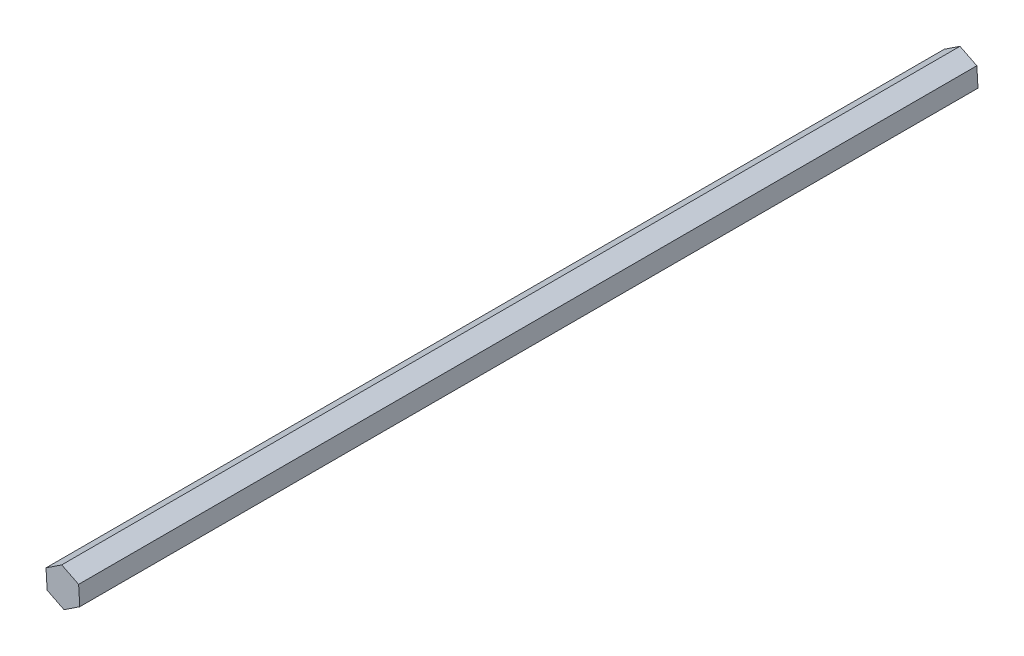
ISO-10303-21;
HEADER;
FILE_DESCRIPTION(('STEP AP214'),'2;1');
FILE_NAME('part.step','',(''),(''),'','','');
FILE_SCHEMA(('AUTOMOTIVE_DESIGN { 1 0 10303 214 1 1 1 1 }'));
ENDSEC;
DATA;
#1=APPLICATION_CONTEXT('core data for automotive mechanical design processes');
#2=APPLICATION_PROTOCOL_DEFINITION('international standard','automotive_design',2000,#1);
#3=PRODUCT_CONTEXT('',#1,'mechanical');
#4=PRODUCT('Part','Part','',(#3));
#5=PRODUCT_RELATED_PRODUCT_CATEGORY('part','',(#4));
#6=PRODUCT_DEFINITION_FORMATION('','',#4);
#7=PRODUCT_DEFINITION_CONTEXT('part definition',#1,'design');
#8=PRODUCT_DEFINITION('design','',#6,#7);
#9=PRODUCT_DEFINITION_SHAPE('','',#8);
#10=(LENGTH_UNIT() NAMED_UNIT(*) SI_UNIT(.MILLI.,.METRE.));
#11=(NAMED_UNIT(*) PLANE_ANGLE_UNIT() SI_UNIT($,.RADIAN.));
#12=(NAMED_UNIT(*) SI_UNIT($,.STERADIAN.) SOLID_ANGLE_UNIT());
#13=UNCERTAINTY_MEASURE_WITH_UNIT(LENGTH_MEASURE(1.E-05),#10,'distance_accuracy_value','');
#14=(GEOMETRIC_REPRESENTATION_CONTEXT(3) GLOBAL_UNCERTAINTY_ASSIGNED_CONTEXT((#13)) GLOBAL_UNIT_ASSIGNED_CONTEXT((#10,
#11,#12)) REPRESENTATION_CONTEXT('',''));
#15=CARTESIAN_POINT('',(0.,0.,0.));
#16=DIRECTION('',(0.,0.,1.));
#17=DIRECTION('',(1.,0.,0.));
#18=AXIS2_PLACEMENT_3D('',#15,#16,#17);
#19=CARTESIAN_POINT('',(6.12625840732226,4.0609676096607,350.));
#20=DIRECTION('',(-0.445579810348125,-0.895242220077968,0.));
#21=DIRECTION('',(0.895242220077968,-0.445579810348126,0.));
#22=AXIS2_PLACEMENT_3D('',#19,#20,#21);
#23=PLANE('',#22);
#24=DIRECTION('',(-0.895242220077968,0.445579810348125,0.));
#25=VECTOR('',#24,1.);
#26=CARTESIAN_POINT('',(6.12625840732226,4.0609676096607,0.));
#27=LINE('',#26,#25);
#28=CARTESIAN_POINT('',(6.12625840732226,4.0609676096607,0.));
#29=VERTEX_POINT('',#28);
#30=CARTESIAN_POINT('',(-0.453771910250806,7.33597921571942,0.));
#31=VERTEX_POINT('',#30);
#32=EDGE_CURVE('E122',#29,#31,#27,.T.);
#33=ORIENTED_EDGE('',*,*,#32,.T.);
#34=DIRECTION('',(0.,0.,-1.));
#35=VECTOR('',#34,1.);
#36=CARTESIAN_POINT('',(-0.453771910250806,7.33597921571942,350.));
#37=LINE('',#36,#35);
#38=CARTESIAN_POINT('',(-0.453771910250806,7.33597921571942,350.));
#39=VERTEX_POINT('',#38);
#40=EDGE_CURVE('E11',#39,#31,#37,.T.);
#41=ORIENTED_EDGE('',*,*,#40,.F.);
#42=DIRECTION('',(-0.895242220077968,0.445579810348125,0.));
#43=VECTOR('',#42,1.);
#44=CARTESIAN_POINT('',(6.12625840732226,4.0609676096607,350.));
#45=LINE('',#44,#43);
#46=CARTESIAN_POINT('',(6.12625840732226,4.0609676096607,350.));
#47=VERTEX_POINT('',#46);
#48=EDGE_CURVE('E135',#47,#39,#45,.T.);
#49=ORIENTED_EDGE('',*,*,#48,.F.);
#50=DIRECTION('',(0.,0.,-1.));
#51=VECTOR('',#50,1.);
#52=CARTESIAN_POINT('',(6.12625840732226,4.0609676096607,350.));
#53=LINE('',#52,#51);
#54=EDGE_CURVE('E118',#47,#29,#53,.T.);
#55=ORIENTED_EDGE('',*,*,#54,.T.);
#56=EDGE_LOOP('',(#33,#41,#49,#55));
#57=FACE_BOUND('',#56,.T.);
#58=ADVANCED_FACE('F39',(#57),#23,.F.);
#59=CARTESIAN_POINT('',(-0.453771910250806,7.33597921571942,350.));
#60=DIRECTION('',(0.552512599953837,-0.833504545213913,0.));
#61=DIRECTION('',(0.833504545213913,0.552512599953837,0.));
#62=AXIS2_PLACEMENT_3D('',#59,#60,#61);
#63=PLANE('',#62);
#64=DIRECTION('',(-0.833504545213913,-0.552512599953837,0.));
#65=VECTOR('',#64,1.);
#66=CARTESIAN_POINT('',(-0.453771910250806,7.33597921571942,0.));
#67=LINE('',#66,#65);
#68=CARTESIAN_POINT('',(-6.58003031757306,3.27501160605872,0.));
#69=VERTEX_POINT('',#68);
#70=EDGE_CURVE('E127',#31,#69,#67,.T.);
#71=ORIENTED_EDGE('',*,*,#70,.T.);
#72=DIRECTION('',(0.,0.,-1.));
#73=VECTOR('',#72,1.);
#74=CARTESIAN_POINT('',(-6.58003031757306,3.27501160605872,350.));
#75=LINE('',#74,#73);
#76=CARTESIAN_POINT('',(-6.58003031757306,3.27501160605872,350.));
#77=VERTEX_POINT('',#76);
#78=EDGE_CURVE('E50',#77,#69,#75,.T.);
#79=ORIENTED_EDGE('',*,*,#78,.F.);
#80=DIRECTION('',(-0.833504545213913,-0.552512599953837,0.));
#81=VECTOR('',#80,1.);
#82=CARTESIAN_POINT('',(-0.453771910250806,7.33597921571942,350.));
#83=LINE('',#82,#81);
#84=EDGE_CURVE('E95',#39,#77,#83,.T.);
#85=ORIENTED_EDGE('',*,*,#84,.F.);
#86=ORIENTED_EDGE('',*,*,#40,.T.);
#87=EDGE_LOOP('',(#71,#79,#85,#86));
#88=FACE_BOUND('',#87,.T.);
#89=ADVANCED_FACE('F160',(#88),#63,.F.);
#90=CARTESIAN_POINT('',(-6.58003031757306,3.27501160605872,350.));
#91=DIRECTION('',(0.998092410301962,0.0617376748640551,0.));
#92=DIRECTION('',(-0.0617376748640551,0.998092410301962,0.));
#93=AXIS2_PLACEMENT_3D('',#90,#91,#92);
#94=PLANE('',#93);
#95=DIRECTION('',(0.0617376748640551,-0.998092410301962,0.));
#96=VECTOR('',#95,1.);
#97=CARTESIAN_POINT('',(-6.58003031757306,3.27501160605872,0.));
#98=LINE('',#97,#96);
#99=CARTESIAN_POINT('',(-6.12625840732226,-4.0609676096607,0.));
#100=VERTEX_POINT('',#99);
#101=EDGE_CURVE('E126',#69,#100,#98,.T.);
#102=ORIENTED_EDGE('',*,*,#101,.T.);
#103=DIRECTION('',(0.,0.,-1.));
#104=VECTOR('',#103,1.);
#105=CARTESIAN_POINT('',(-6.12625840732226,-4.0609676096607,350.));
#106=LINE('',#105,#104);
#107=CARTESIAN_POINT('',(-6.12625840732226,-4.0609676096607,350.));
#108=VERTEX_POINT('',#107);
#109=EDGE_CURVE('E111',#108,#100,#106,.T.);
#110=ORIENTED_EDGE('',*,*,#109,.F.);
#111=DIRECTION('',(0.0617376748640551,-0.998092410301962,0.));
#112=VECTOR('',#111,1.);
#113=CARTESIAN_POINT('',(-6.58003031757306,3.27501160605872,350.));
#114=LINE('',#113,#112);
#115=EDGE_CURVE('E104',#77,#108,#114,.T.);
#116=ORIENTED_EDGE('',*,*,#115,.F.);
#117=ORIENTED_EDGE('',*,*,#78,.T.);
#118=EDGE_LOOP('',(#102,#110,#116,#117));
#119=FACE_BOUND('',#118,.T.);
#120=ADVANCED_FACE('F138',(#119),#94,.F.);
#121=CARTESIAN_POINT('',(-6.12625840732226,-4.0609676096607,350.));
#122=DIRECTION('',(0.445579810348126,0.895242220077968,0.));
#123=DIRECTION('',(-0.895242220077968,0.445579810348126,0.));
#124=AXIS2_PLACEMENT_3D('',#121,#122,#123);
#125=PLANE('',#124);
#126=DIRECTION('',(0.895242220077968,-0.445579810348126,0.));
#127=VECTOR('',#126,1.);
#128=CARTESIAN_POINT('',(-6.12625840732226,-4.0609676096607,0.));
#129=LINE('',#128,#127);
#130=CARTESIAN_POINT('',(0.453771910250804,-7.33597921571942,0.));
#131=VERTEX_POINT('',#130);
#132=EDGE_CURVE('E114',#100,#131,#129,.T.);
#133=ORIENTED_EDGE('',*,*,#132,.T.);
#134=DIRECTION('',(0.,0.,-1.));
#135=VECTOR('',#134,1.);
#136=CARTESIAN_POINT('',(0.453771910250804,-7.33597921571942,350.));
#137=LINE('',#136,#135);
#138=CARTESIAN_POINT('',(0.453771910250804,-7.33597921571942,350.));
#139=VERTEX_POINT('',#138);
#140=EDGE_CURVE('E109',#139,#131,#137,.T.);
#141=ORIENTED_EDGE('',*,*,#140,.F.);
#142=DIRECTION('',(0.895242220077968,-0.445579810348126,0.));
#143=VECTOR('',#142,1.);
#144=CARTESIAN_POINT('',(-6.12625840732226,-4.0609676096607,350.));
#145=LINE('',#144,#143);
#146=EDGE_CURVE('E97',#108,#139,#145,.T.);
#147=ORIENTED_EDGE('',*,*,#146,.F.);
#148=ORIENTED_EDGE('',*,*,#109,.T.);
#149=EDGE_LOOP('',(#133,#141,#147,#148));
#150=FACE_BOUND('',#149,.T.);
#151=ADVANCED_FACE('F112',(#150),#125,.F.);
#152=CARTESIAN_POINT('',(0.453771910250804,-7.33597921571942,350.));
#153=DIRECTION('',(-0.552512599953837,0.833504545213913,0.));
#154=DIRECTION('',(-0.833504545213913,-0.552512599953837,0.));
#155=AXIS2_PLACEMENT_3D('',#152,#153,#154);
#156=PLANE('',#155);
#157=DIRECTION('',(0.833504545213913,0.552512599953837,0.));
#158=VECTOR('',#157,1.);
#159=CARTESIAN_POINT('',(0.453771910250804,-7.33597921571942,0.));
#160=LINE('',#159,#158);
#161=CARTESIAN_POINT('',(6.58003031757306,-3.27501160605872,0.));
#162=VERTEX_POINT('',#161);
#163=EDGE_CURVE('E80',#131,#162,#160,.T.);
#164=ORIENTED_EDGE('',*,*,#163,.T.);
#165=DIRECTION('',(0.,0.,-1.));
#166=VECTOR('',#165,1.);
#167=CARTESIAN_POINT('',(6.58003031757306,-3.27501160605872,350.));
#168=LINE('',#167,#166);
#169=CARTESIAN_POINT('',(6.58003031757306,-3.27501160605872,350.));
#170=VERTEX_POINT('',#169);
#171=EDGE_CURVE('E113',#170,#162,#168,.T.);
#172=ORIENTED_EDGE('',*,*,#171,.F.);
#173=DIRECTION('',(0.833504545213913,0.552512599953837,0.));
#174=VECTOR('',#173,1.);
#175=CARTESIAN_POINT('',(0.453771910250804,-7.33597921571942,350.));
#176=LINE('',#175,#174);
#177=EDGE_CURVE('E103',#139,#170,#176,.T.);
#178=ORIENTED_EDGE('',*,*,#177,.F.);
#179=ORIENTED_EDGE('',*,*,#140,.T.);
#180=EDGE_LOOP('',(#164,#172,#178,#179));
#181=FACE_BOUND('',#180,.T.);
#182=ADVANCED_FACE('F116',(#181),#156,.F.);
#183=CARTESIAN_POINT('',(6.58003031757306,-3.27501160605872,350.));
#184=DIRECTION('',(-0.998092410301962,-0.0617376748640547,0.));
#185=DIRECTION('',(0.0617376748640547,-0.998092410301962,0.));
#186=AXIS2_PLACEMENT_3D('',#183,#184,#185);
#187=PLANE('',#186);
#188=DIRECTION('',(-0.0617376748640547,0.998092410301962,0.));
#189=VECTOR('',#188,1.);
#190=CARTESIAN_POINT('',(6.58003031757306,-3.27501160605872,0.));
#191=LINE('',#190,#189);
#192=EDGE_CURVE('E83',#162,#29,#191,.T.);
#193=ORIENTED_EDGE('',*,*,#192,.T.);
#194=ORIENTED_EDGE('',*,*,#54,.F.);
#195=DIRECTION('',(-0.0617376748640547,0.998092410301962,0.));
#196=VECTOR('',#195,1.);
#197=CARTESIAN_POINT('',(6.58003031757306,-3.27501160605872,350.));
#198=LINE('',#197,#196);
#199=EDGE_CURVE('E54',#170,#47,#198,.T.);
#200=ORIENTED_EDGE('',*,*,#199,.F.);
#201=ORIENTED_EDGE('',*,*,#171,.T.);
#202=EDGE_LOOP('',(#193,#194,#200,#201));
#203=FACE_BOUND('',#202,.T.);
#204=ADVANCED_FACE('F148',(#203),#187,.F.);
#205=CARTESIAN_POINT('',(0.,0.,350.));
#206=DIRECTION('',(0.,0.,1.));
#207=DIRECTION('',(1.,0.,0.));
#208=AXIS2_PLACEMENT_3D('',#205,#206,#207);
#209=PLANE('',#208);
#210=ORIENTED_EDGE('',*,*,#48,.T.);
#211=ORIENTED_EDGE('',*,*,#84,.T.);
#212=ORIENTED_EDGE('',*,*,#115,.T.);
#213=ORIENTED_EDGE('',*,*,#146,.T.);
#214=ORIENTED_EDGE('',*,*,#177,.T.);
#215=ORIENTED_EDGE('',*,*,#199,.T.);
#216=EDGE_LOOP('',(#210,#211,#212,#213,#214,#215));
#217=FACE_BOUND('',#216,.T.);
#218=ADVANCED_FACE('F101',(#217),#209,.T.);
#219=CARTESIAN_POINT('',(0.,0.,0.));
#220=DIRECTION('',(0.,0.,1.));
#221=DIRECTION('',(1.,0.,0.));
#222=AXIS2_PLACEMENT_3D('',#219,#220,#221);
#223=PLANE('',#222);
#224=ORIENTED_EDGE('',*,*,#32,.F.);
#225=ORIENTED_EDGE('',*,*,#192,.F.);
#226=ORIENTED_EDGE('',*,*,#163,.F.);
#227=ORIENTED_EDGE('',*,*,#132,.F.);
#228=ORIENTED_EDGE('',*,*,#101,.F.);
#229=ORIENTED_EDGE('',*,*,#70,.F.);
#230=EDGE_LOOP('',(#224,#225,#226,#227,#228,#229));
#231=FACE_BOUND('',#230,.T.);
#232=ADVANCED_FACE('F142',(#231),#223,.F.);
#233=CLOSED_SHELL('',(#58,#89,#120,#151,#182,#204,#218,#232));
#234=MANIFOLD_SOLID_BREP('B2',#233);
#235=ADVANCED_BREP_SHAPE_REPRESENTATION('',(#18,#234),#14);
#236=SHAPE_DEFINITION_REPRESENTATION(#9,#235);
ENDSEC;
END-ISO-10303-21;
